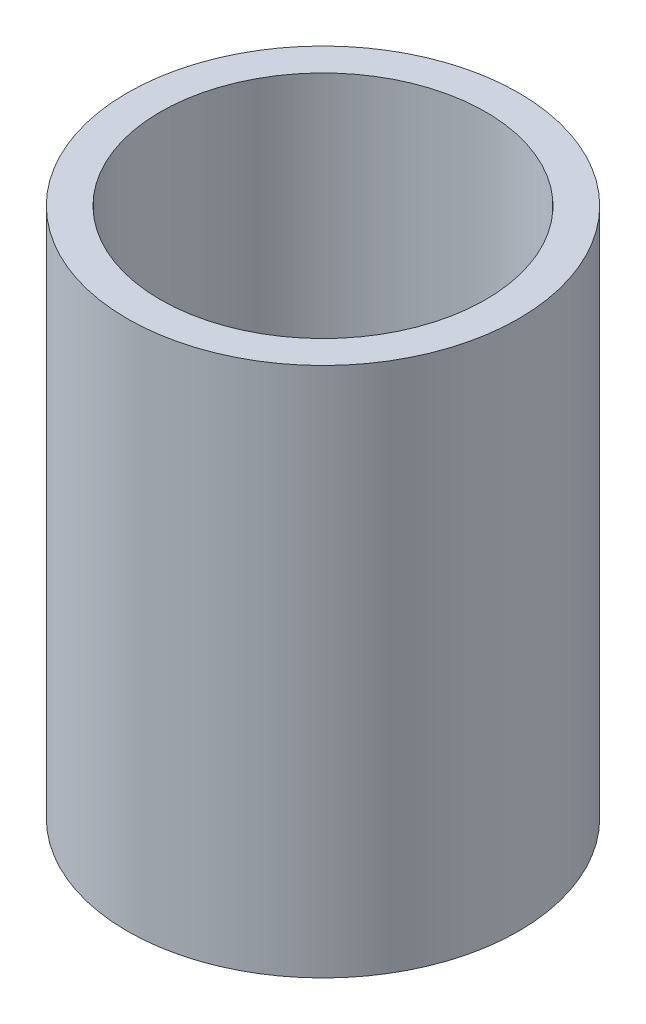
ISO-10303-21;
HEADER;
FILE_DESCRIPTION(('STEP AP214'),'2;1');
FILE_NAME('part.step','',(''),(''),'','','');
FILE_SCHEMA(('AUTOMOTIVE_DESIGN { 1 0 10303 214 1 1 1 1 }'));
ENDSEC;
DATA;
#1=APPLICATION_CONTEXT('core data for automotive mechanical design processes');
#2=APPLICATION_PROTOCOL_DEFINITION('international standard','automotive_design',2000,#1);
#3=PRODUCT_CONTEXT('',#1,'mechanical');
#4=PRODUCT('Part','Part','',(#3));
#5=PRODUCT_RELATED_PRODUCT_CATEGORY('part','',(#4));
#6=PRODUCT_DEFINITION_FORMATION('','',#4);
#7=PRODUCT_DEFINITION_CONTEXT('part definition',#1,'design');
#8=PRODUCT_DEFINITION('design','',#6,#7);
#9=PRODUCT_DEFINITION_SHAPE('','',#8);
#10=(LENGTH_UNIT() NAMED_UNIT(*) SI_UNIT(.MILLI.,.METRE.));
#11=(NAMED_UNIT(*) PLANE_ANGLE_UNIT() SI_UNIT($,.RADIAN.));
#12=(NAMED_UNIT(*) SI_UNIT($,.STERADIAN.) SOLID_ANGLE_UNIT());
#13=UNCERTAINTY_MEASURE_WITH_UNIT(LENGTH_MEASURE(1.E-05),#10,'distance_accuracy_value','');
#14=(GEOMETRIC_REPRESENTATION_CONTEXT(3) GLOBAL_UNCERTAINTY_ASSIGNED_CONTEXT((#13)) GLOBAL_UNIT_ASSIGNED_CONTEXT((#10,
#11,#12)) REPRESENTATION_CONTEXT('',''));
#15=CARTESIAN_POINT('',(0.,0.,0.));
#16=DIRECTION('',(0.,0.,1.));
#17=DIRECTION('',(1.,0.,0.));
#18=AXIS2_PLACEMENT_3D('',#15,#16,#17);
#19=CARTESIAN_POINT('',(0.,57.15,0.));
#20=DIRECTION('',(0.,1.,0.));
#21=DIRECTION('',(0.,0.,1.));
#22=AXIS2_PLACEMENT_3D('',#19,#20,#21);
#23=PLANE('',#22);
#24=CARTESIAN_POINT('',(0.,57.15,0.));
#25=DIRECTION('',(0.,1.,0.));
#26=DIRECTION('',(0.,0.,1.));
#27=AXIS2_PLACEMENT_3D('',#24,#25,#26);
#28=CIRCLE('',#27,21.082);
#29=CARTESIAN_POINT('',(0.,57.15,21.082));
#30=VERTEX_POINT('',#29);
#31=EDGE_CURVE('E10',#30,#30,#28,.T.);
#32=ORIENTED_EDGE('',*,*,#31,.T.);
#33=EDGE_LOOP('',(#32));
#34=FACE_BOUND('',#33,.T.);
#35=CARTESIAN_POINT('',(0.,57.15,0.));
#36=DIRECTION('',(0.,1.,0.));
#37=DIRECTION('',(0.,0.,1.));
#38=AXIS2_PLACEMENT_3D('',#35,#36,#37);
#39=CIRCLE('',#38,17.526);
#40=CARTESIAN_POINT('',(0.,57.15,17.526));
#41=VERTEX_POINT('',#40);
#42=EDGE_CURVE('E46',#41,#41,#39,.T.);
#43=ORIENTED_EDGE('',*,*,#42,.F.);
#44=EDGE_LOOP('',(#43));
#45=FACE_BOUND('',#44,.T.);
#46=ADVANCED_FACE('F35',(#34,#45),#23,.T.);
#47=CARTESIAN_POINT('',(0.,0.,0.));
#48=DIRECTION('',(0.,1.,0.));
#49=DIRECTION('',(0.,0.,1.));
#50=AXIS2_PLACEMENT_3D('',#47,#48,#49);
#51=PLANE('',#50);
#52=CARTESIAN_POINT('',(0.,0.,0.));
#53=DIRECTION('',(0.,1.,0.));
#54=DIRECTION('',(0.,0.,1.));
#55=AXIS2_PLACEMENT_3D('',#52,#53,#54);
#56=CIRCLE('',#55,21.082);
#57=CARTESIAN_POINT('',(0.,0.,21.082));
#58=VERTEX_POINT('',#57);
#59=EDGE_CURVE('E39',#58,#58,#56,.T.);
#60=ORIENTED_EDGE('',*,*,#59,.F.);
#61=EDGE_LOOP('',(#60));
#62=FACE_BOUND('',#61,.T.);
#63=CARTESIAN_POINT('',(0.,0.,0.));
#64=DIRECTION('',(0.,1.,0.));
#65=DIRECTION('',(0.,0.,1.));
#66=AXIS2_PLACEMENT_3D('',#63,#64,#65);
#67=CIRCLE('',#66,17.526);
#68=CARTESIAN_POINT('',(0.,0.,17.526));
#69=VERTEX_POINT('',#68);
#70=EDGE_CURVE('E48',#69,#69,#67,.T.);
#71=ORIENTED_EDGE('',*,*,#70,.T.);
#72=EDGE_LOOP('',(#71));
#73=FACE_BOUND('',#72,.T.);
#74=ADVANCED_FACE('F58',(#62,#73),#51,.F.);
#75=CARTESIAN_POINT('',(0.,57.15,0.));
#76=DIRECTION('',(0.,-1.,0.));
#77=DIRECTION('',(0.,0.,-1.));
#78=AXIS2_PLACEMENT_3D('',#75,#76,#77);
#79=CYLINDRICAL_SURFACE('',#78,21.082);
#80=ORIENTED_EDGE('',*,*,#31,.F.);
#81=EDGE_LOOP('',(#80));
#82=FACE_BOUND('',#81,.T.);
#83=ORIENTED_EDGE('',*,*,#59,.T.);
#84=EDGE_LOOP('',(#83));
#85=FACE_BOUND('',#84,.T.);
#86=ADVANCED_FACE('F37',(#82,#85),#79,.T.);
#87=CARTESIAN_POINT('',(0.,57.15,0.));
#88=DIRECTION('',(0.,-1.,0.));
#89=DIRECTION('',(0.,0.,-1.));
#90=AXIS2_PLACEMENT_3D('',#87,#88,#89);
#91=CYLINDRICAL_SURFACE('',#90,17.526);
#92=ORIENTED_EDGE('',*,*,#42,.T.);
#93=EDGE_LOOP('',(#92));
#94=FACE_BOUND('',#93,.T.);
#95=ORIENTED_EDGE('',*,*,#70,.F.);
#96=EDGE_LOOP('',(#95));
#97=FACE_BOUND('',#96,.T.);
#98=ADVANCED_FACE('F54',(#94,#97),#91,.F.);
#99=CLOSED_SHELL('',(#46,#74,#86,#98));
#100=MANIFOLD_SOLID_BREP('B2',#99);
#101=ADVANCED_BREP_SHAPE_REPRESENTATION('',(#18,#100),#14);
#102=SHAPE_DEFINITION_REPRESENTATION(#9,#101);
ENDSEC;
END-ISO-10303-21;
